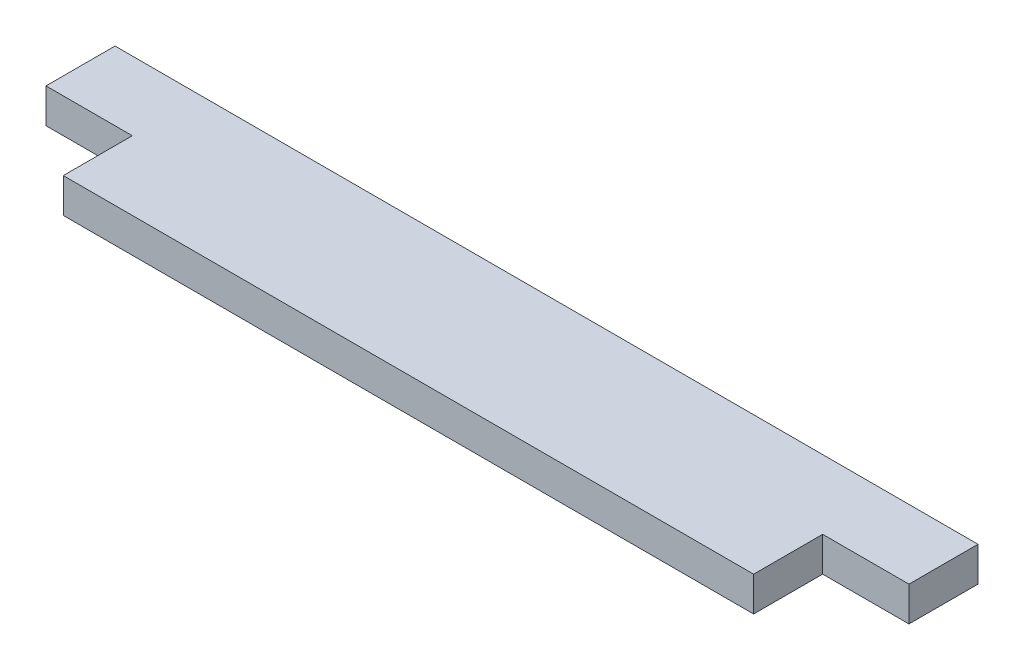
ISO-10303-21;
HEADER;
FILE_DESCRIPTION(('STEP AP214'),'2;1');
FILE_NAME('part.step','',(''),(''),'','','');
FILE_SCHEMA(('AUTOMOTIVE_DESIGN { 1 0 10303 214 1 1 1 1 }'));
ENDSEC;
DATA;
#1=APPLICATION_CONTEXT('core data for automotive mechanical design processes');
#2=APPLICATION_PROTOCOL_DEFINITION('international standard','automotive_design',2000,#1);
#3=PRODUCT_CONTEXT('',#1,'mechanical');
#4=PRODUCT('Part','Part','',(#3));
#5=PRODUCT_RELATED_PRODUCT_CATEGORY('part','',(#4));
#6=PRODUCT_DEFINITION_FORMATION('','',#4);
#7=PRODUCT_DEFINITION_CONTEXT('part definition',#1,'design');
#8=PRODUCT_DEFINITION('design','',#6,#7);
#9=PRODUCT_DEFINITION_SHAPE('','',#8);
#10=(LENGTH_UNIT() NAMED_UNIT(*) SI_UNIT(.MILLI.,.METRE.));
#11=(NAMED_UNIT(*) PLANE_ANGLE_UNIT() SI_UNIT($,.RADIAN.));
#12=(NAMED_UNIT(*) SI_UNIT($,.STERADIAN.) SOLID_ANGLE_UNIT());
#13=UNCERTAINTY_MEASURE_WITH_UNIT(LENGTH_MEASURE(1.E-05),#10,'distance_accuracy_value','');
#14=(GEOMETRIC_REPRESENTATION_CONTEXT(3) GLOBAL_UNCERTAINTY_ASSIGNED_CONTEXT((#13)) GLOBAL_UNIT_ASSIGNED_CONTEXT((#10,
#11,#12)) REPRESENTATION_CONTEXT('',''));
#15=CARTESIAN_POINT('',(0.,0.,0.));
#16=DIRECTION('',(0.,0.,1.));
#17=DIRECTION('',(1.,0.,0.));
#18=AXIS2_PLACEMENT_3D('',#15,#16,#17);
#19=CARTESIAN_POINT('',(42.7413793103448,2.,0.));
#20=DIRECTION('',(1.,0.,0.));
#21=DIRECTION('',(0.,0.,-1.));
#22=AXIS2_PLACEMENT_3D('',#19,#20,#21);
#23=PLANE('',#22);
#24=DIRECTION('',(0.,0.,1.));
#25=VECTOR('',#24,1.);
#26=CARTESIAN_POINT('',(42.7413793103448,0.,0.));
#27=LINE('',#26,#25);
#28=CARTESIAN_POINT('',(42.7413793103448,0.,-1.70689655172414));
#29=VERTEX_POINT('',#28);
#30=CARTESIAN_POINT('',(42.7413793103448,0.,2.29310344827586));
#31=VERTEX_POINT('',#30);
#32=EDGE_CURVE('E140',#29,#31,#27,.T.);
#33=ORIENTED_EDGE('',*,*,#32,.F.);
#34=DIRECTION('',(0.,-1.,0.));
#35=VECTOR('',#34,1.);
#36=CARTESIAN_POINT('',(42.7413793103448,2.,-1.70689655172414));
#37=LINE('',#36,#35);
#38=CARTESIAN_POINT('',(42.7413793103448,2.,-1.70689655172414));
#39=VERTEX_POINT('',#38);
#40=EDGE_CURVE('E11',#39,#29,#37,.T.);
#41=ORIENTED_EDGE('',*,*,#40,.F.);
#42=DIRECTION('',(0.,0.,1.));
#43=VECTOR('',#42,1.);
#44=CARTESIAN_POINT('',(42.7413793103448,2.,0.));
#45=LINE('',#44,#43);
#46=CARTESIAN_POINT('',(42.7413793103448,2.,2.29310344827586));
#47=VERTEX_POINT('',#46);
#48=EDGE_CURVE('E194',#39,#47,#45,.T.);
#49=ORIENTED_EDGE('',*,*,#48,.T.);
#50=DIRECTION('',(0.,-1.,0.));
#51=VECTOR('',#50,1.);
#52=CARTESIAN_POINT('',(42.7413793103448,2.,2.29310344827586));
#53=LINE('',#52,#51);
#54=EDGE_CURVE('E92',#47,#31,#53,.T.);
#55=ORIENTED_EDGE('',*,*,#54,.T.);
#56=EDGE_LOOP('',(#33,#41,#49,#55));
#57=FACE_BOUND('',#56,.T.);
#58=ADVANCED_FACE('F41',(#57),#23,.T.);
#59=CARTESIAN_POINT('',(0.,2.,-1.70689655172414));
#60=DIRECTION('',(0.,0.,-1.));
#61=DIRECTION('',(-1.,0.,0.));
#62=AXIS2_PLACEMENT_3D('',#59,#60,#61);
#63=PLANE('',#62);
#64=DIRECTION('',(1.,0.,0.));
#65=VECTOR('',#64,1.);
#66=CARTESIAN_POINT('',(0.,0.,-1.70689655172414));
#67=LINE('',#66,#65);
#68=CARTESIAN_POINT('',(-7.25862068965517,0.,-1.70689655172414));
#69=VERTEX_POINT('',#68);
#70=EDGE_CURVE('E144',#69,#29,#67,.T.);
#71=ORIENTED_EDGE('',*,*,#70,.F.);
#72=DIRECTION('',(0.,-1.,0.));
#73=VECTOR('',#72,1.);
#74=CARTESIAN_POINT('',(-7.25862068965517,2.,-1.70689655172414));
#75=LINE('',#74,#73);
#76=CARTESIAN_POINT('',(-7.25862068965517,2.,-1.70689655172414));
#77=VERTEX_POINT('',#76);
#78=EDGE_CURVE('E50',#77,#69,#75,.T.);
#79=ORIENTED_EDGE('',*,*,#78,.F.);
#80=DIRECTION('',(1.,0.,0.));
#81=VECTOR('',#80,1.);
#82=CARTESIAN_POINT('',(0.,2.,-1.70689655172414));
#83=LINE('',#82,#81);
#84=EDGE_CURVE('E192',#77,#39,#83,.T.);
#85=ORIENTED_EDGE('',*,*,#84,.T.);
#86=ORIENTED_EDGE('',*,*,#40,.T.);
#87=EDGE_LOOP('',(#71,#79,#85,#86));
#88=FACE_BOUND('',#87,.T.);
#89=ADVANCED_FACE('F191',(#88),#63,.T.);
#90=CARTESIAN_POINT('',(-7.25862068965517,2.,0.));
#91=DIRECTION('',(1.,0.,0.));
#92=DIRECTION('',(0.,0.,-1.));
#93=AXIS2_PLACEMENT_3D('',#90,#91,#92);
#94=PLANE('',#93);
#95=DIRECTION('',(0.,0.,1.));
#96=VECTOR('',#95,1.);
#97=CARTESIAN_POINT('',(-7.25862068965517,0.,0.));
#98=LINE('',#97,#96);
#99=CARTESIAN_POINT('',(-7.25862068965517,0.,2.29310344827586));
#100=VERTEX_POINT('',#99);
#101=EDGE_CURVE('E148',#69,#100,#98,.T.);
#102=ORIENTED_EDGE('',*,*,#101,.T.);
#103=DIRECTION('',(0.,-1.,0.));
#104=VECTOR('',#103,1.);
#105=CARTESIAN_POINT('',(-7.25862068965517,2.,2.29310344827586));
#106=LINE('',#105,#104);
#107=CARTESIAN_POINT('',(-7.25862068965517,2.,2.29310344827586));
#108=VERTEX_POINT('',#107);
#109=EDGE_CURVE('E173',#108,#100,#106,.T.);
#110=ORIENTED_EDGE('',*,*,#109,.F.);
#111=DIRECTION('',(0.,0.,1.));
#112=VECTOR('',#111,1.);
#113=CARTESIAN_POINT('',(-7.25862068965517,2.,0.));
#114=LINE('',#113,#112);
#115=EDGE_CURVE('E182',#77,#108,#114,.T.);
#116=ORIENTED_EDGE('',*,*,#115,.F.);
#117=ORIENTED_EDGE('',*,*,#78,.T.);
#118=EDGE_LOOP('',(#102,#110,#116,#117));
#119=FACE_BOUND('',#118,.T.);
#120=ADVANCED_FACE('F180',(#119),#94,.F.);
#121=CARTESIAN_POINT('',(0.,2.,2.29310344827586));
#122=DIRECTION('',(0.,0.,-1.));
#123=DIRECTION('',(-1.,0.,0.));
#124=AXIS2_PLACEMENT_3D('',#121,#122,#123);
#125=PLANE('',#124);
#126=DIRECTION('',(1.,0.,0.));
#127=VECTOR('',#126,1.);
#128=CARTESIAN_POINT('',(0.,0.,2.29310344827586));
#129=LINE('',#128,#127);
#130=CARTESIAN_POINT('',(-2.25862068965517,0.,2.29310344827586));
#131=VERTEX_POINT('',#130);
#132=EDGE_CURVE('E151',#100,#131,#129,.T.);
#133=ORIENTED_EDGE('',*,*,#132,.T.);
#134=DIRECTION('',(0.,-1.,0.));
#135=VECTOR('',#134,1.);
#136=CARTESIAN_POINT('',(-2.25862068965517,2.,2.29310344827586));
#137=LINE('',#136,#135);
#138=CARTESIAN_POINT('',(-2.25862068965517,2.,2.29310344827586));
#139=VERTEX_POINT('',#138);
#140=EDGE_CURVE('E169',#139,#131,#137,.T.);
#141=ORIENTED_EDGE('',*,*,#140,.F.);
#142=DIRECTION('',(1.,0.,0.));
#143=VECTOR('',#142,1.);
#144=CARTESIAN_POINT('',(0.,2.,2.29310344827586));
#145=LINE('',#144,#143);
#146=EDGE_CURVE('E137',#108,#139,#145,.T.);
#147=ORIENTED_EDGE('',*,*,#146,.F.);
#148=ORIENTED_EDGE('',*,*,#109,.T.);
#149=EDGE_LOOP('',(#133,#141,#147,#148));
#150=FACE_BOUND('',#149,.T.);
#151=ADVANCED_FACE('F206',(#150),#125,.F.);
#152=CARTESIAN_POINT('',(-2.25862068965517,2.,0.));
#153=DIRECTION('',(1.,0.,0.));
#154=DIRECTION('',(0.,0.,-1.));
#155=AXIS2_PLACEMENT_3D('',#152,#153,#154);
#156=PLANE('',#155);
#157=DIRECTION('',(0.,0.,1.));
#158=VECTOR('',#157,1.);
#159=CARTESIAN_POINT('',(-2.25862068965517,0.,0.));
#160=LINE('',#159,#158);
#161=CARTESIAN_POINT('',(-2.25862068965517,0.,6.29310344827586));
#162=VERTEX_POINT('',#161);
#163=EDGE_CURVE('E154',#131,#162,#160,.T.);
#164=ORIENTED_EDGE('',*,*,#163,.T.);
#165=DIRECTION('',(0.,-1.,0.));
#166=VECTOR('',#165,1.);
#167=CARTESIAN_POINT('',(-2.25862068965517,2.,6.29310344827586));
#168=LINE('',#167,#166);
#169=CARTESIAN_POINT('',(-2.25862068965517,2.,6.29310344827586));
#170=VERTEX_POINT('',#169);
#171=EDGE_CURVE('E130',#170,#162,#168,.T.);
#172=ORIENTED_EDGE('',*,*,#171,.F.);
#173=DIRECTION('',(0.,0.,1.));
#174=VECTOR('',#173,1.);
#175=CARTESIAN_POINT('',(-2.25862068965517,2.,0.));
#176=LINE('',#175,#174);
#177=EDGE_CURVE('E115',#139,#170,#176,.T.);
#178=ORIENTED_EDGE('',*,*,#177,.F.);
#179=ORIENTED_EDGE('',*,*,#140,.T.);
#180=EDGE_LOOP('',(#164,#172,#178,#179));
#181=FACE_BOUND('',#180,.T.);
#182=ADVANCED_FACE('F208',(#181),#156,.F.);
#183=CARTESIAN_POINT('',(0.,2.,6.29310344827586));
#184=DIRECTION('',(0.,0.,-1.));
#185=DIRECTION('',(-1.,0.,0.));
#186=AXIS2_PLACEMENT_3D('',#183,#184,#185);
#187=PLANE('',#186);
#188=DIRECTION('',(1.,0.,0.));
#189=VECTOR('',#188,1.);
#190=CARTESIAN_POINT('',(0.,0.,6.29310344827586));
#191=LINE('',#190,#189);
#192=CARTESIAN_POINT('',(37.7413793103448,0.,6.29310344827586));
#193=VERTEX_POINT('',#192);
#194=EDGE_CURVE('E125',#162,#193,#191,.T.);
#195=ORIENTED_EDGE('',*,*,#194,.T.);
#196=DIRECTION('',(0.,-1.,0.));
#197=VECTOR('',#196,1.);
#198=CARTESIAN_POINT('',(37.7413793103448,2.,6.29310344827586));
#199=LINE('',#198,#197);
#200=CARTESIAN_POINT('',(37.7413793103448,2.,6.29310344827586));
#201=VERTEX_POINT('',#200);
#202=EDGE_CURVE('E122',#201,#193,#199,.T.);
#203=ORIENTED_EDGE('',*,*,#202,.F.);
#204=DIRECTION('',(1.,0.,0.));
#205=VECTOR('',#204,1.);
#206=CARTESIAN_POINT('',(0.,2.,6.29310344827586));
#207=LINE('',#206,#205);
#208=EDGE_CURVE('E109',#170,#201,#207,.T.);
#209=ORIENTED_EDGE('',*,*,#208,.F.);
#210=ORIENTED_EDGE('',*,*,#171,.T.);
#211=EDGE_LOOP('',(#195,#203,#209,#210));
#212=FACE_BOUND('',#211,.T.);
#213=ADVANCED_FACE('F123',(#212),#187,.F.);
#214=CARTESIAN_POINT('',(37.7413793103448,2.,0.));
#215=DIRECTION('',(1.,0.,0.));
#216=DIRECTION('',(0.,0.,-1.));
#217=AXIS2_PLACEMENT_3D('',#214,#215,#216);
#218=PLANE('',#217);
#219=DIRECTION('',(0.,0.,1.));
#220=VECTOR('',#219,1.);
#221=CARTESIAN_POINT('',(37.7413793103448,0.,0.));
#222=LINE('',#221,#220);
#223=CARTESIAN_POINT('',(37.7413793103448,0.,2.29310344827586));
#224=VERTEX_POINT('',#223);
#225=EDGE_CURVE('E160',#224,#193,#222,.T.);
#226=ORIENTED_EDGE('',*,*,#225,.F.);
#227=DIRECTION('',(0.,-1.,0.));
#228=VECTOR('',#227,1.);
#229=CARTESIAN_POINT('',(37.7413793103448,2.,2.29310344827586));
#230=LINE('',#229,#228);
#231=CARTESIAN_POINT('',(37.7413793103448,2.,2.29310344827586));
#232=VERTEX_POINT('',#231);
#233=EDGE_CURVE('E85',#232,#224,#230,.T.);
#234=ORIENTED_EDGE('',*,*,#233,.F.);
#235=DIRECTION('',(0.,0.,1.));
#236=VECTOR('',#235,1.);
#237=CARTESIAN_POINT('',(37.7413793103448,2.,0.));
#238=LINE('',#237,#236);
#239=EDGE_CURVE('E113',#232,#201,#238,.T.);
#240=ORIENTED_EDGE('',*,*,#239,.T.);
#241=ORIENTED_EDGE('',*,*,#202,.T.);
#242=EDGE_LOOP('',(#226,#234,#240,#241));
#243=FACE_BOUND('',#242,.T.);
#244=ADVANCED_FACE('F132',(#243),#218,.T.);
#245=EDGE_CURVE('E155',#224,#31,#129,.T.);
#246=ORIENTED_EDGE('',*,*,#245,.T.);
#247=ORIENTED_EDGE('',*,*,#54,.F.);
#248=EDGE_CURVE('E58',#232,#47,#145,.T.);
#249=ORIENTED_EDGE('',*,*,#248,.F.);
#250=ORIENTED_EDGE('',*,*,#233,.T.);
#251=EDGE_LOOP('',(#246,#247,#249,#250));
#252=FACE_BOUND('',#251,.T.);
#253=ADVANCED_FACE('F217',(#252),#125,.F.);
#254=CARTESIAN_POINT('',(0.,2.,0.));
#255=DIRECTION('',(0.,1.,0.));
#256=DIRECTION('',(0.,0.,1.));
#257=AXIS2_PLACEMENT_3D('',#254,#255,#256);
#258=PLANE('',#257);
#259=ORIENTED_EDGE('',*,*,#48,.F.);
#260=ORIENTED_EDGE('',*,*,#84,.F.);
#261=ORIENTED_EDGE('',*,*,#115,.T.);
#262=ORIENTED_EDGE('',*,*,#146,.T.);
#263=ORIENTED_EDGE('',*,*,#177,.T.);
#264=ORIENTED_EDGE('',*,*,#208,.T.);
#265=ORIENTED_EDGE('',*,*,#239,.F.);
#266=ORIENTED_EDGE('',*,*,#248,.T.);
#267=EDGE_LOOP('',(#259,#260,#261,#262,#263,#264,#265,#266));
#268=FACE_BOUND('',#267,.T.);
#269=ADVANCED_FACE('F111',(#268),#258,.T.);
#270=CARTESIAN_POINT('',(0.,0.,0.));
#271=DIRECTION('',(0.,1.,0.));
#272=DIRECTION('',(0.,0.,1.));
#273=AXIS2_PLACEMENT_3D('',#270,#271,#272);
#274=PLANE('',#273);
#275=ORIENTED_EDGE('',*,*,#32,.T.);
#276=ORIENTED_EDGE('',*,*,#245,.F.);
#277=ORIENTED_EDGE('',*,*,#225,.T.);
#278=ORIENTED_EDGE('',*,*,#194,.F.);
#279=ORIENTED_EDGE('',*,*,#163,.F.);
#280=ORIENTED_EDGE('',*,*,#132,.F.);
#281=ORIENTED_EDGE('',*,*,#101,.F.);
#282=ORIENTED_EDGE('',*,*,#70,.T.);
#283=EDGE_LOOP('',(#275,#276,#277,#278,#279,#280,#281,#282));
#284=FACE_BOUND('',#283,.T.);
#285=ADVANCED_FACE('F189',(#284),#274,.F.);
#286=CLOSED_SHELL('',(#58,#89,#120,#151,#182,#213,#244,#253,#269,#285));
#287=MANIFOLD_SOLID_BREP('B2',#286);
#288=ADVANCED_BREP_SHAPE_REPRESENTATION('',(#18,#287),#14);
#289=SHAPE_DEFINITION_REPRESENTATION(#9,#288);
ENDSEC;
END-ISO-10303-21;
